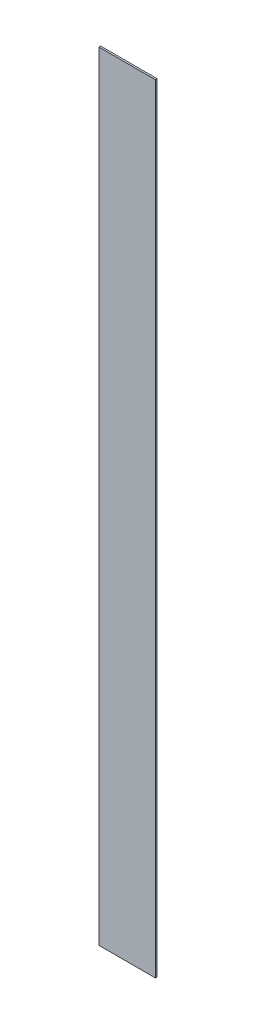
ISO-10303-21;
HEADER;
FILE_DESCRIPTION(('STEP AP214'),'2;1');
FILE_NAME('part.step','',(''),(''),'','','');
FILE_SCHEMA(('AUTOMOTIVE_DESIGN { 1 0 10303 214 1 1 1 1 }'));
ENDSEC;
DATA;
#1=APPLICATION_CONTEXT('core data for automotive mechanical design processes');
#2=APPLICATION_PROTOCOL_DEFINITION('international standard','automotive_design',2000,#1);
#3=PRODUCT_CONTEXT('',#1,'mechanical');
#4=PRODUCT('Part','Part','',(#3));
#5=PRODUCT_RELATED_PRODUCT_CATEGORY('part','',(#4));
#6=PRODUCT_DEFINITION_FORMATION('','',#4);
#7=PRODUCT_DEFINITION_CONTEXT('part definition',#1,'design');
#8=PRODUCT_DEFINITION('design','',#6,#7);
#9=PRODUCT_DEFINITION_SHAPE('','',#8);
#10=(LENGTH_UNIT() NAMED_UNIT(*) SI_UNIT(.MILLI.,.METRE.));
#11=(NAMED_UNIT(*) PLANE_ANGLE_UNIT() SI_UNIT($,.RADIAN.));
#12=(NAMED_UNIT(*) SI_UNIT($,.STERADIAN.) SOLID_ANGLE_UNIT());
#13=UNCERTAINTY_MEASURE_WITH_UNIT(LENGTH_MEASURE(1.E-05),#10,'distance_accuracy_value','');
#14=(GEOMETRIC_REPRESENTATION_CONTEXT(3) GLOBAL_UNCERTAINTY_ASSIGNED_CONTEXT((#13)) GLOBAL_UNIT_ASSIGNED_CONTEXT((#10,
#11,#12)) REPRESENTATION_CONTEXT('',''));
#15=CARTESIAN_POINT('',(0.,0.,0.));
#16=DIRECTION('',(0.,0.,1.));
#17=DIRECTION('',(1.,0.,0.));
#18=AXIS2_PLACEMENT_3D('',#15,#16,#17);
#19=CARTESIAN_POINT('',(12.7,-174.625,0.396875));
#20=DIRECTION('',(-1.,0.,0.));
#21=DIRECTION('',(0.,0.,1.));
#22=AXIS2_PLACEMENT_3D('',#19,#20,#21);
#23=PLANE('',#22);
#24=DIRECTION('',(0.,1.,0.));
#25=VECTOR('',#24,1.);
#26=CARTESIAN_POINT('',(12.7,-174.625,-0.396875));
#27=LINE('',#26,#25);
#28=CARTESIAN_POINT('',(12.7,-174.625,-0.396875));
#29=VERTEX_POINT('',#28);
#30=CARTESIAN_POINT('',(12.7,174.625,-0.396875));
#31=VERTEX_POINT('',#30);
#32=EDGE_CURVE('E96',#29,#31,#27,.T.);
#33=ORIENTED_EDGE('',*,*,#32,.T.);
#34=DIRECTION('',(0.,0.,-1.));
#35=VECTOR('',#34,1.);
#36=CARTESIAN_POINT('',(12.7,174.625,0.396875));
#37=LINE('',#36,#35);
#38=CARTESIAN_POINT('',(12.7,174.625,0.396875));
#39=VERTEX_POINT('',#38);
#40=EDGE_CURVE('E11',#39,#31,#37,.T.);
#41=ORIENTED_EDGE('',*,*,#40,.F.);
#42=DIRECTION('',(0.,1.,0.));
#43=VECTOR('',#42,1.);
#44=CARTESIAN_POINT('',(12.7,-174.625,0.396875));
#45=LINE('',#44,#43);
#46=CARTESIAN_POINT('',(12.7,-174.625,0.396875));
#47=VERTEX_POINT('',#46);
#48=EDGE_CURVE('E84',#47,#39,#45,.T.);
#49=ORIENTED_EDGE('',*,*,#48,.F.);
#50=DIRECTION('',(0.,0.,-1.));
#51=VECTOR('',#50,1.);
#52=CARTESIAN_POINT('',(12.7,-174.625,0.396875));
#53=LINE('',#52,#51);
#54=EDGE_CURVE('E92',#47,#29,#53,.T.);
#55=ORIENTED_EDGE('',*,*,#54,.T.);
#56=EDGE_LOOP('',(#33,#41,#49,#55));
#57=FACE_BOUND('',#56,.T.);
#58=ADVANCED_FACE('F33',(#57),#23,.F.);
#59=CARTESIAN_POINT('',(-12.7,174.625,0.396875));
#60=DIRECTION('',(0.,-1.,0.));
#61=DIRECTION('',(0.,0.,-1.));
#62=AXIS2_PLACEMENT_3D('',#59,#60,#61);
#63=PLANE('',#62);
#64=DIRECTION('',(-1.,0.,0.));
#65=VECTOR('',#64,1.);
#66=CARTESIAN_POINT('',(-12.7,174.625,-0.396875));
#67=LINE('',#66,#65);
#68=CARTESIAN_POINT('',(-12.7,174.625,-0.396875));
#69=VERTEX_POINT('',#68);
#70=EDGE_CURVE('E88',#31,#69,#67,.T.);
#71=ORIENTED_EDGE('',*,*,#70,.T.);
#72=DIRECTION('',(0.,0.,-1.));
#73=VECTOR('',#72,1.);
#74=CARTESIAN_POINT('',(-12.7,174.625,0.396875));
#75=LINE('',#74,#73);
#76=CARTESIAN_POINT('',(-12.7,174.625,0.396875));
#77=VERTEX_POINT('',#76);
#78=EDGE_CURVE('E41',#77,#69,#75,.T.);
#79=ORIENTED_EDGE('',*,*,#78,.F.);
#80=DIRECTION('',(-1.,0.,0.));
#81=VECTOR('',#80,1.);
#82=CARTESIAN_POINT('',(-12.7,174.625,0.396875));
#83=LINE('',#82,#81);
#84=EDGE_CURVE('E79',#39,#77,#83,.T.);
#85=ORIENTED_EDGE('',*,*,#84,.F.);
#86=ORIENTED_EDGE('',*,*,#40,.T.);
#87=EDGE_LOOP('',(#71,#79,#85,#86));
#88=FACE_BOUND('',#87,.T.);
#89=ADVANCED_FACE('F87',(#88),#63,.F.);
#90=CARTESIAN_POINT('',(-12.7,-174.625,0.396875));
#91=DIRECTION('',(1.,0.,0.));
#92=DIRECTION('',(0.,0.,-1.));
#93=AXIS2_PLACEMENT_3D('',#90,#91,#92);
#94=PLANE('',#93);
#95=DIRECTION('',(0.,-1.,0.));
#96=VECTOR('',#95,1.);
#97=CARTESIAN_POINT('',(-12.7,-174.625,-0.396875));
#98=LINE('',#97,#96);
#99=CARTESIAN_POINT('',(-12.7,-174.625,-0.396875));
#100=VERTEX_POINT('',#99);
#101=EDGE_CURVE('E66',#69,#100,#98,.T.);
#102=ORIENTED_EDGE('',*,*,#101,.T.);
#103=DIRECTION('',(0.,0.,-1.));
#104=VECTOR('',#103,1.);
#105=CARTESIAN_POINT('',(-12.7,-174.625,0.396875));
#106=LINE('',#105,#104);
#107=CARTESIAN_POINT('',(-12.7,-174.625,0.396875));
#108=VERTEX_POINT('',#107);
#109=EDGE_CURVE('E89',#108,#100,#106,.T.);
#110=ORIENTED_EDGE('',*,*,#109,.F.);
#111=DIRECTION('',(0.,-1.,0.));
#112=VECTOR('',#111,1.);
#113=CARTESIAN_POINT('',(-12.7,-174.625,0.396875));
#114=LINE('',#113,#112);
#115=EDGE_CURVE('E82',#77,#108,#114,.T.);
#116=ORIENTED_EDGE('',*,*,#115,.F.);
#117=ORIENTED_EDGE('',*,*,#78,.T.);
#118=EDGE_LOOP('',(#102,#110,#116,#117));
#119=FACE_BOUND('',#118,.T.);
#120=ADVANCED_FACE('F90',(#119),#94,.F.);
#121=CARTESIAN_POINT('',(-12.7,-174.625,0.396875));
#122=DIRECTION('',(0.,1.,0.));
#123=DIRECTION('',(0.,0.,1.));
#124=AXIS2_PLACEMENT_3D('',#121,#122,#123);
#125=PLANE('',#124);
#126=DIRECTION('',(1.,0.,0.));
#127=VECTOR('',#126,1.);
#128=CARTESIAN_POINT('',(-12.7,-174.625,-0.396875));
#129=LINE('',#128,#127);
#130=EDGE_CURVE('E72',#100,#29,#129,.T.);
#131=ORIENTED_EDGE('',*,*,#130,.T.);
#132=ORIENTED_EDGE('',*,*,#54,.F.);
#133=DIRECTION('',(1.,0.,0.));
#134=VECTOR('',#133,1.);
#135=CARTESIAN_POINT('',(-12.7,-174.625,0.396875));
#136=LINE('',#135,#134);
#137=EDGE_CURVE('E49',#108,#47,#136,.T.);
#138=ORIENTED_EDGE('',*,*,#137,.F.);
#139=ORIENTED_EDGE('',*,*,#109,.T.);
#140=EDGE_LOOP('',(#131,#132,#138,#139));
#141=FACE_BOUND('',#140,.T.);
#142=ADVANCED_FACE('F103',(#141),#125,.F.);
#143=CARTESIAN_POINT('',(0.,0.,0.396875));
#144=DIRECTION('',(0.,0.,-1.));
#145=DIRECTION('',(-1.,0.,0.));
#146=AXIS2_PLACEMENT_3D('',#143,#144,#145);
#147=PLANE('',#146);
#148=ORIENTED_EDGE('',*,*,#48,.T.);
#149=ORIENTED_EDGE('',*,*,#84,.T.);
#150=ORIENTED_EDGE('',*,*,#115,.T.);
#151=ORIENTED_EDGE('',*,*,#137,.T.);
#152=EDGE_LOOP('',(#148,#149,#150,#151));
#153=FACE_BOUND('',#152,.T.);
#154=ADVANCED_FACE('F80',(#153),#147,.F.);
#155=CARTESIAN_POINT('',(0.,0.,-0.396875));
#156=DIRECTION('',(0.,0.,-1.));
#157=DIRECTION('',(-1.,0.,0.));
#158=AXIS2_PLACEMENT_3D('',#155,#156,#157);
#159=PLANE('',#158);
#160=ORIENTED_EDGE('',*,*,#32,.F.);
#161=ORIENTED_EDGE('',*,*,#130,.F.);
#162=ORIENTED_EDGE('',*,*,#101,.F.);
#163=ORIENTED_EDGE('',*,*,#70,.F.);
#164=EDGE_LOOP('',(#160,#161,#162,#163));
#165=FACE_BOUND('',#164,.T.);
#166=ADVANCED_FACE('F106',(#165),#159,.T.);
#167=CLOSED_SHELL('',(#58,#89,#120,#142,#154,#166));
#168=MANIFOLD_SOLID_BREP('B2',#167);
#169=ADVANCED_BREP_SHAPE_REPRESENTATION('',(#18,#168),#14);
#170=SHAPE_DEFINITION_REPRESENTATION(#9,#169);
ENDSEC;
END-ISO-10303-21;
